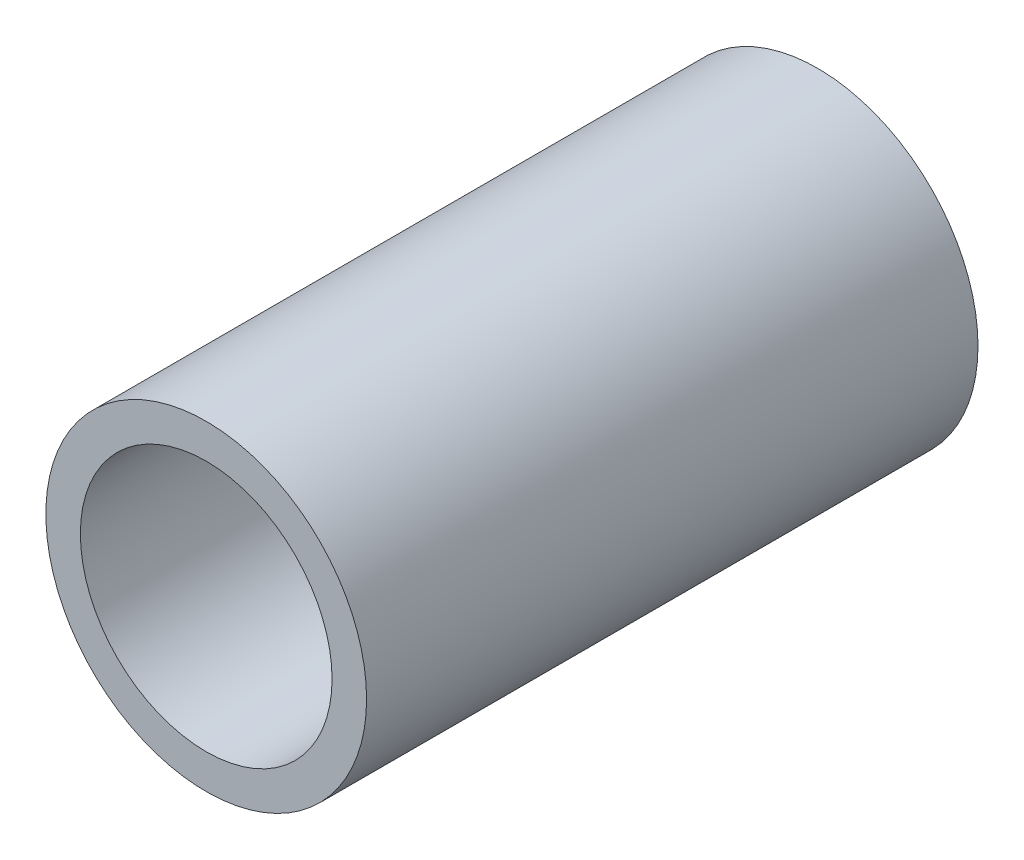
ISO-10303-21;
HEADER;
FILE_DESCRIPTION(('STEP AP214'),'2;1');
FILE_NAME('part.step','',(''),(''),'','','');
FILE_SCHEMA(('AUTOMOTIVE_DESIGN { 1 0 10303 214 1 1 1 1 }'));
ENDSEC;
DATA;
#1=APPLICATION_CONTEXT('core data for automotive mechanical design processes');
#2=APPLICATION_PROTOCOL_DEFINITION('international standard','automotive_design',2000,#1);
#3=PRODUCT_CONTEXT('',#1,'mechanical');
#4=PRODUCT('Part','Part','',(#3));
#5=PRODUCT_RELATED_PRODUCT_CATEGORY('part','',(#4));
#6=PRODUCT_DEFINITION_FORMATION('','',#4);
#7=PRODUCT_DEFINITION_CONTEXT('part definition',#1,'design');
#8=PRODUCT_DEFINITION('design','',#6,#7);
#9=PRODUCT_DEFINITION_SHAPE('','',#8);
#10=(LENGTH_UNIT() NAMED_UNIT(*) SI_UNIT(.MILLI.,.METRE.));
#11=(NAMED_UNIT(*) PLANE_ANGLE_UNIT() SI_UNIT($,.RADIAN.));
#12=(NAMED_UNIT(*) SI_UNIT($,.STERADIAN.) SOLID_ANGLE_UNIT());
#13=UNCERTAINTY_MEASURE_WITH_UNIT(LENGTH_MEASURE(1.E-05),#10,'distance_accuracy_value','');
#14=(GEOMETRIC_REPRESENTATION_CONTEXT(3) GLOBAL_UNCERTAINTY_ASSIGNED_CONTEXT((#13)) GLOBAL_UNIT_ASSIGNED_CONTEXT((#10,
#11,#12)) REPRESENTATION_CONTEXT('',''));
#15=CARTESIAN_POINT('',(0.,0.,0.));
#16=DIRECTION('',(0.,0.,1.));
#17=DIRECTION('',(1.,0.,0.));
#18=AXIS2_PLACEMENT_3D('',#15,#16,#17);
#19=CARTESIAN_POINT('',(0.,0.,762.));
#20=DIRECTION('',(0.,0.,-1.));
#21=DIRECTION('',(-1.,0.,0.));
#22=AXIS2_PLACEMENT_3D('',#19,#20,#21);
#23=CYLINDRICAL_SURFACE('',#22,13.335);
#24=CARTESIAN_POINT('',(0.,0.,-762.));
#25=DIRECTION('',(0.,0.,1.));
#26=DIRECTION('',(1.,0.,0.));
#27=AXIS2_PLACEMENT_3D('',#24,#25,#26);
#28=CIRCLE('',#27,13.335);
#29=CARTESIAN_POINT('',(13.335,0.,-762.));
#30=VERTEX_POINT('',#29);
#31=EDGE_CURVE('E11',#30,#30,#28,.T.);
#32=ORIENTED_EDGE('',*,*,#31,.T.);
#33=EDGE_LOOP('',(#32));
#34=FACE_BOUND('',#33,.T.);
#35=CARTESIAN_POINT('',(0.,0.,-711.15896875));
#36=DIRECTION('',(0.,0.,1.));
#37=DIRECTION('',(1.,0.,0.));
#38=AXIS2_PLACEMENT_3D('',#35,#36,#37);
#39=CIRCLE('',#38,13.335);
#40=CARTESIAN_POINT('',(13.335,0.,-711.15896875));
#41=VERTEX_POINT('',#40);
#42=EDGE_CURVE('E58',#41,#41,#39,.F.);
#43=ORIENTED_EDGE('',*,*,#42,.T.);
#44=EDGE_LOOP('',(#43));
#45=FACE_BOUND('',#44,.T.);
#46=ADVANCED_FACE('F43',(#34,#45),#23,.T.);
#47=CARTESIAN_POINT('',(0.,0.,762.));
#48=DIRECTION('',(0.,0.,-1.));
#49=DIRECTION('',(-1.,0.,0.));
#50=AXIS2_PLACEMENT_3D('',#47,#48,#49);
#51=CYLINDRICAL_SURFACE('',#50,10.4648);
#52=CARTESIAN_POINT('',(0.,0.,-762.));
#53=DIRECTION('',(0.,0.,1.));
#54=DIRECTION('',(1.,0.,0.));
#55=AXIS2_PLACEMENT_3D('',#52,#53,#54);
#56=CIRCLE('',#55,10.4648);
#57=CARTESIAN_POINT('',(10.4648,0.,-762.));
#58=VERTEX_POINT('',#57);
#59=EDGE_CURVE('E51',#58,#58,#56,.T.);
#60=ORIENTED_EDGE('',*,*,#59,.F.);
#61=EDGE_LOOP('',(#60));
#62=FACE_BOUND('',#61,.T.);
#63=CARTESIAN_POINT('',(0.,0.,-711.15896875));
#64=DIRECTION('',(0.,0.,1.));
#65=DIRECTION('',(1.,0.,0.));
#66=AXIS2_PLACEMENT_3D('',#63,#64,#65);
#67=CIRCLE('',#66,10.4648);
#68=CARTESIAN_POINT('',(10.4648,0.,-711.15896875));
#69=VERTEX_POINT('',#68);
#70=EDGE_CURVE('E46',#69,#69,#67,.T.);
#71=ORIENTED_EDGE('',*,*,#70,.T.);
#72=EDGE_LOOP('',(#71));
#73=FACE_BOUND('',#72,.T.);
#74=ADVANCED_FACE('F67',(#62,#73),#51,.F.);
#75=CARTESIAN_POINT('',(0.,0.,-762.));
#76=DIRECTION('',(0.,0.,1.));
#77=DIRECTION('',(1.,0.,0.));
#78=AXIS2_PLACEMENT_3D('',#75,#76,#77);
#79=PLANE('',#78);
#80=ORIENTED_EDGE('',*,*,#59,.T.);
#81=EDGE_LOOP('',(#80));
#82=FACE_BOUND('',#81,.T.);
#83=ORIENTED_EDGE('',*,*,#31,.F.);
#84=EDGE_LOOP('',(#83));
#85=FACE_BOUND('',#84,.T.);
#86=ADVANCED_FACE('F72',(#82,#85),#79,.F.);
#87=CARTESIAN_POINT('',(0.,0.,-711.15896875));
#88=DIRECTION('',(0.,0.,1.));
#89=DIRECTION('',(1.,0.,0.));
#90=AXIS2_PLACEMENT_3D('',#87,#88,#89);
#91=PLANE('',#90);
#92=ORIENTED_EDGE('',*,*,#70,.F.);
#93=EDGE_LOOP('',(#92));
#94=FACE_BOUND('',#93,.T.);
#95=ORIENTED_EDGE('',*,*,#42,.F.);
#96=EDGE_LOOP('',(#95));
#97=FACE_BOUND('',#96,.T.);
#98=ADVANCED_FACE('F69',(#94,#97),#91,.T.);
#99=CLOSED_SHELL('',(#46,#74,#86,#98));
#100=MANIFOLD_SOLID_BREP('B2',#99);
#101=ADVANCED_BREP_SHAPE_REPRESENTATION('',(#18,#100),#14);
#102=SHAPE_DEFINITION_REPRESENTATION(#9,#101);
ENDSEC;
END-ISO-10303-21;
